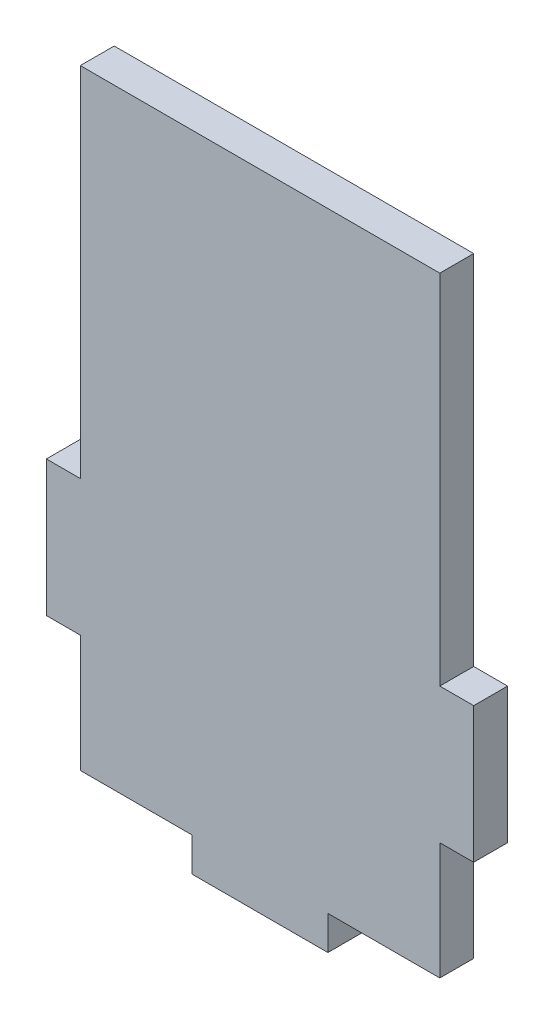
ISO-10303-21;
HEADER;
FILE_DESCRIPTION(('STEP AP214'),'2;1');
FILE_NAME('part.step','',(''),(''),'','','');
FILE_SCHEMA(('AUTOMOTIVE_DESIGN { 1 0 10303 214 1 1 1 1 }'));
ENDSEC;
DATA;
#1=APPLICATION_CONTEXT('core data for automotive mechanical design processes');
#2=APPLICATION_PROTOCOL_DEFINITION('international standard','automotive_design',2000,#1);
#3=PRODUCT_CONTEXT('',#1,'mechanical');
#4=PRODUCT('Part','Part','',(#3));
#5=PRODUCT_RELATED_PRODUCT_CATEGORY('part','',(#4));
#6=PRODUCT_DEFINITION_FORMATION('','',#4);
#7=PRODUCT_DEFINITION_CONTEXT('part definition',#1,'design');
#8=PRODUCT_DEFINITION('design','',#6,#7);
#9=PRODUCT_DEFINITION_SHAPE('','',#8);
#10=(LENGTH_UNIT() NAMED_UNIT(*) SI_UNIT(.MILLI.,.METRE.));
#11=(NAMED_UNIT(*) PLANE_ANGLE_UNIT() SI_UNIT($,.RADIAN.));
#12=(NAMED_UNIT(*) SI_UNIT($,.STERADIAN.) SOLID_ANGLE_UNIT());
#13=UNCERTAINTY_MEASURE_WITH_UNIT(LENGTH_MEASURE(1.E-05),#10,'distance_accuracy_value','');
#14=(GEOMETRIC_REPRESENTATION_CONTEXT(3) GLOBAL_UNCERTAINTY_ASSIGNED_CONTEXT((#13)) GLOBAL_UNIT_ASSIGNED_CONTEXT((#10,
#11,#12)) REPRESENTATION_CONTEXT('',''));
#15=CARTESIAN_POINT('',(0.,0.,0.));
#16=DIRECTION('',(0.,0.,1.));
#17=DIRECTION('',(1.,0.,0.));
#18=AXIS2_PLACEMENT_3D('',#15,#16,#17);
#19=CARTESIAN_POINT('',(26.5,0.,5.));
#20=DIRECTION('',(1.,0.,0.));
#21=DIRECTION('',(0.,0.,-1.));
#22=AXIS2_PLACEMENT_3D('',#19,#20,#21);
#23=PLANE('',#22);
#24=DIRECTION('',(0.,-1.,0.));
#25=VECTOR('',#24,1.);
#26=CARTESIAN_POINT('',(26.5,0.,0.));
#27=LINE('',#26,#25);
#28=CARTESIAN_POINT('',(26.5,-27.7248614841831,0.));
#29=VERTEX_POINT('',#28);
#30=CARTESIAN_POINT('',(26.5,-45.,0.));
#31=VERTEX_POINT('',#30);
#32=EDGE_CURVE('E174',#29,#31,#27,.T.);
#33=ORIENTED_EDGE('',*,*,#32,.F.);
#34=DIRECTION('',(0.,0.,-1.));
#35=VECTOR('',#34,1.);
#36=CARTESIAN_POINT('',(26.5,-27.7248614841831,5.));
#37=LINE('',#36,#35);
#38=CARTESIAN_POINT('',(26.5,-27.7248614841831,5.));
#39=VERTEX_POINT('',#38);
#40=EDGE_CURVE('E11',#39,#29,#37,.T.);
#41=ORIENTED_EDGE('',*,*,#40,.F.);
#42=DIRECTION('',(0.,-1.,0.));
#43=VECTOR('',#42,1.);
#44=CARTESIAN_POINT('',(26.5,0.,5.));
#45=LINE('',#44,#43);
#46=CARTESIAN_POINT('',(26.5,-45.,5.));
#47=VERTEX_POINT('',#46);
#48=EDGE_CURVE('E214',#39,#47,#45,.T.);
#49=ORIENTED_EDGE('',*,*,#48,.T.);
#50=DIRECTION('',(0.,0.,-1.));
#51=VECTOR('',#50,1.);
#52=CARTESIAN_POINT('',(26.5,-45.,5.));
#53=LINE('',#52,#51);
#54=EDGE_CURVE('E107',#47,#31,#53,.T.);
#55=ORIENTED_EDGE('',*,*,#54,.T.);
#56=EDGE_LOOP('',(#33,#41,#49,#55));
#57=FACE_BOUND('',#56,.T.);
#58=ADVANCED_FACE('F33',(#57),#23,.T.);
#59=CARTESIAN_POINT('',(-1.11022302462516E-13,-27.724861484183,5.));
#60=DIRECTION('',(0.,-1.,0.));
#61=DIRECTION('',(1.,0.,0.));
#62=AXIS2_PLACEMENT_3D('',#59,#60,#61);
#63=PLANE('',#62);
#64=DIRECTION('',(-1.,0.,0.));
#65=VECTOR('',#64,1.);
#66=CARTESIAN_POINT('',(-1.11022302462516E-13,-27.724861484183,0.));
#67=LINE('',#66,#65);
#68=CARTESIAN_POINT('',(31.5000000000001,-27.7248614841831,0.));
#69=VERTEX_POINT('',#68);
#70=EDGE_CURVE('E177',#69,#29,#67,.T.);
#71=ORIENTED_EDGE('',*,*,#70,.F.);
#72=DIRECTION('',(0.,0.,-1.));
#73=VECTOR('',#72,1.);
#74=CARTESIAN_POINT('',(31.5000000000001,-27.7248614841831,5.));
#75=LINE('',#74,#73);
#76=CARTESIAN_POINT('',(31.5000000000001,-27.7248614841831,5.));
#77=VERTEX_POINT('',#76);
#78=EDGE_CURVE('E41',#77,#69,#75,.T.);
#79=ORIENTED_EDGE('',*,*,#78,.F.);
#80=DIRECTION('',(-1.,0.,0.));
#81=VECTOR('',#80,1.);
#82=CARTESIAN_POINT('',(-1.11022302462516E-13,-27.724861484183,5.));
#83=LINE('',#82,#81);
#84=EDGE_CURVE('E264',#77,#39,#83,.T.);
#85=ORIENTED_EDGE('',*,*,#84,.T.);
#86=ORIENTED_EDGE('',*,*,#40,.T.);
#87=EDGE_LOOP('',(#71,#79,#85,#86));
#88=FACE_BOUND('',#87,.T.);
#89=ADVANCED_FACE('F250',(#88),#63,.T.);
#90=CARTESIAN_POINT('',(31.5000000000001,0.,5.));
#91=DIRECTION('',(1.,0.,0.));
#92=DIRECTION('',(0.,1.,0.));
#93=AXIS2_PLACEMENT_3D('',#90,#91,#92);
#94=PLANE('',#93);
#95=DIRECTION('',(0.,-1.,0.));
#96=VECTOR('',#95,1.);
#97=CARTESIAN_POINT('',(31.5000000000001,0.,0.));
#98=LINE('',#97,#96);
#99=CARTESIAN_POINT('',(31.5000000000001,-7.72486148418305,0.));
#100=VERTEX_POINT('',#99);
#101=EDGE_CURVE('E180',#100,#69,#98,.T.);
#102=ORIENTED_EDGE('',*,*,#101,.F.);
#103=DIRECTION('',(0.,0.,-1.));
#104=VECTOR('',#103,1.);
#105=CARTESIAN_POINT('',(31.5000000000001,-7.72486148418305,5.));
#106=LINE('',#105,#104);
#107=CARTESIAN_POINT('',(31.5000000000001,-7.72486148418305,5.));
#108=VERTEX_POINT('',#107);
#109=EDGE_CURVE('E239',#108,#100,#106,.T.);
#110=ORIENTED_EDGE('',*,*,#109,.F.);
#111=DIRECTION('',(0.,-1.,0.));
#112=VECTOR('',#111,1.);
#113=CARTESIAN_POINT('',(31.5000000000001,0.,5.));
#114=LINE('',#113,#112);
#115=EDGE_CURVE('E246',#108,#77,#114,.T.);
#116=ORIENTED_EDGE('',*,*,#115,.T.);
#117=ORIENTED_EDGE('',*,*,#78,.T.);
#118=EDGE_LOOP('',(#102,#110,#116,#117));
#119=FACE_BOUND('',#118,.T.);
#120=ADVANCED_FACE('F244',(#119),#94,.T.);
#121=CARTESIAN_POINT('',(0.,-7.724861484183,5.));
#122=DIRECTION('',(0.,-1.,0.));
#123=DIRECTION('',(1.,0.,0.));
#124=AXIS2_PLACEMENT_3D('',#121,#122,#123);
#125=PLANE('',#124);
#126=DIRECTION('',(-1.,0.,0.));
#127=VECTOR('',#126,1.);
#128=CARTESIAN_POINT('',(0.,-7.724861484183,0.));
#129=LINE('',#128,#127);
#130=CARTESIAN_POINT('',(26.5,-7.72486148418305,0.));
#131=VERTEX_POINT('',#130);
#132=EDGE_CURVE('E183',#100,#131,#129,.T.);
#133=ORIENTED_EDGE('',*,*,#132,.T.);
#134=DIRECTION('',(0.,0.,-1.));
#135=VECTOR('',#134,1.);
#136=CARTESIAN_POINT('',(26.5,-7.72486148418305,5.));
#137=LINE('',#136,#135);
#138=CARTESIAN_POINT('',(26.5,-7.72486148418305,5.));
#139=VERTEX_POINT('',#138);
#140=EDGE_CURVE('E237',#139,#131,#137,.T.);
#141=ORIENTED_EDGE('',*,*,#140,.F.);
#142=DIRECTION('',(-1.,0.,0.));
#143=VECTOR('',#142,1.);
#144=CARTESIAN_POINT('',(0.,-7.724861484183,5.));
#145=LINE('',#144,#143);
#146=EDGE_CURVE('E260',#108,#139,#145,.T.);
#147=ORIENTED_EDGE('',*,*,#146,.F.);
#148=ORIENTED_EDGE('',*,*,#109,.T.);
#149=EDGE_LOOP('',(#133,#141,#147,#148));
#150=FACE_BOUND('',#149,.T.);
#151=ADVANCED_FACE('F257',(#150),#125,.F.);
#152=CARTESIAN_POINT('',(26.5,0.,5.));
#153=DIRECTION('',(1.,0.,0.));
#154=DIRECTION('',(0.,1.,0.));
#155=AXIS2_PLACEMENT_3D('',#152,#153,#154);
#156=PLANE('',#155);
#157=DIRECTION('',(0.,-1.,0.));
#158=VECTOR('',#157,1.);
#159=CARTESIAN_POINT('',(26.5,0.,0.));
#160=LINE('',#159,#158);
#161=CARTESIAN_POINT('',(26.5,45.,0.));
#162=VERTEX_POINT('',#161);
#163=EDGE_CURVE('E186',#162,#131,#160,.T.);
#164=ORIENTED_EDGE('',*,*,#163,.F.);
#165=DIRECTION('',(0.,0.,-1.));
#166=VECTOR('',#165,1.);
#167=CARTESIAN_POINT('',(26.5,45.,5.));
#168=LINE('',#167,#166);
#169=CARTESIAN_POINT('',(26.5,45.,5.));
#170=VERTEX_POINT('',#169);
#171=EDGE_CURVE('E235',#170,#162,#168,.T.);
#172=ORIENTED_EDGE('',*,*,#171,.F.);
#173=DIRECTION('',(0.,-1.,0.));
#174=VECTOR('',#173,1.);
#175=CARTESIAN_POINT('',(26.5,0.,5.));
#176=LINE('',#175,#174);
#177=EDGE_CURVE('E262',#170,#139,#176,.T.);
#178=ORIENTED_EDGE('',*,*,#177,.T.);
#179=ORIENTED_EDGE('',*,*,#140,.T.);
#180=EDGE_LOOP('',(#164,#172,#178,#179));
#181=FACE_BOUND('',#180,.T.);
#182=ADVANCED_FACE('F307',(#181),#156,.T.);
#183=CARTESIAN_POINT('',(0.,45.,5.));
#184=DIRECTION('',(0.,1.,0.));
#185=DIRECTION('',(0.,0.,1.));
#186=AXIS2_PLACEMENT_3D('',#183,#184,#185);
#187=PLANE('',#186);
#188=DIRECTION('',(1.,0.,0.));
#189=VECTOR('',#188,1.);
#190=CARTESIAN_POINT('',(0.,45.,0.));
#191=LINE('',#190,#189);
#192=CARTESIAN_POINT('',(-26.5,45.,0.));
#193=VERTEX_POINT('',#192);
#194=EDGE_CURVE('E189',#193,#162,#191,.T.);
#195=ORIENTED_EDGE('',*,*,#194,.F.);
#196=DIRECTION('',(0.,0.,-1.));
#197=VECTOR('',#196,1.);
#198=CARTESIAN_POINT('',(-26.5,45.,5.));
#199=LINE('',#198,#197);
#200=CARTESIAN_POINT('',(-26.5,45.,5.));
#201=VERTEX_POINT('',#200);
#202=EDGE_CURVE('E233',#201,#193,#199,.T.);
#203=ORIENTED_EDGE('',*,*,#202,.F.);
#204=DIRECTION('',(1.,0.,0.));
#205=VECTOR('',#204,1.);
#206=CARTESIAN_POINT('',(0.,45.,5.));
#207=LINE('',#206,#205);
#208=EDGE_CURVE('E270',#201,#170,#207,.T.);
#209=ORIENTED_EDGE('',*,*,#208,.T.);
#210=ORIENTED_EDGE('',*,*,#171,.T.);
#211=EDGE_LOOP('',(#195,#203,#209,#210));
#212=FACE_BOUND('',#211,.T.);
#213=ADVANCED_FACE('F310',(#212),#187,.T.);
#214=CARTESIAN_POINT('',(-26.5,0.,5.));
#215=DIRECTION('',(1.,0.,0.));
#216=DIRECTION('',(0.,1.,0.));
#217=AXIS2_PLACEMENT_3D('',#214,#215,#216);
#218=PLANE('',#217);
#219=DIRECTION('',(0.,-1.,0.));
#220=VECTOR('',#219,1.);
#221=CARTESIAN_POINT('',(-26.5,0.,0.));
#222=LINE('',#221,#220);
#223=CARTESIAN_POINT('',(-26.5,-7.72486148418305,0.));
#224=VERTEX_POINT('',#223);
#225=EDGE_CURVE('E192',#193,#224,#222,.T.);
#226=ORIENTED_EDGE('',*,*,#225,.T.);
#227=DIRECTION('',(0.,0.,-1.));
#228=VECTOR('',#227,1.);
#229=CARTESIAN_POINT('',(-26.5,-7.72486148418305,5.));
#230=LINE('',#229,#228);
#231=CARTESIAN_POINT('',(-26.5,-7.72486148418305,5.));
#232=VERTEX_POINT('',#231);
#233=EDGE_CURVE('E231',#232,#224,#230,.T.);
#234=ORIENTED_EDGE('',*,*,#233,.F.);
#235=DIRECTION('',(0.,-1.,0.));
#236=VECTOR('',#235,1.);
#237=CARTESIAN_POINT('',(-26.5,0.,5.));
#238=LINE('',#237,#236);
#239=EDGE_CURVE('E273',#201,#232,#238,.T.);
#240=ORIENTED_EDGE('',*,*,#239,.F.);
#241=ORIENTED_EDGE('',*,*,#202,.T.);
#242=EDGE_LOOP('',(#226,#234,#240,#241));
#243=FACE_BOUND('',#242,.T.);
#244=ADVANCED_FACE('F314',(#243),#218,.F.);
#245=CARTESIAN_POINT('',(0.,-7.724861484183,5.));
#246=DIRECTION('',(0.,1.,0.));
#247=DIRECTION('',(-1.,0.,0.));
#248=AXIS2_PLACEMENT_3D('',#245,#246,#247);
#249=PLANE('',#248);
#250=DIRECTION('',(1.,0.,0.));
#251=VECTOR('',#250,1.);
#252=CARTESIAN_POINT('',(0.,-7.724861484183,0.));
#253=LINE('',#252,#251);
#254=CARTESIAN_POINT('',(-31.5000000000001,-7.72486148418305,0.));
#255=VERTEX_POINT('',#254);
#256=EDGE_CURVE('E195',#255,#224,#253,.T.);
#257=ORIENTED_EDGE('',*,*,#256,.F.);
#258=DIRECTION('',(0.,0.,-1.));
#259=VECTOR('',#258,1.);
#260=CARTESIAN_POINT('',(-31.5000000000001,-7.72486148418305,5.));
#261=LINE('',#260,#259);
#262=CARTESIAN_POINT('',(-31.5000000000001,-7.72486148418305,5.));
#263=VERTEX_POINT('',#262);
#264=EDGE_CURVE('E229',#263,#255,#261,.T.);
#265=ORIENTED_EDGE('',*,*,#264,.F.);
#266=DIRECTION('',(1.,0.,0.));
#267=VECTOR('',#266,1.);
#268=CARTESIAN_POINT('',(0.,-7.724861484183,5.));
#269=LINE('',#268,#267);
#270=EDGE_CURVE('E275',#263,#232,#269,.T.);
#271=ORIENTED_EDGE('',*,*,#270,.T.);
#272=ORIENTED_EDGE('',*,*,#233,.T.);
#273=EDGE_LOOP('',(#257,#265,#271,#272));
#274=FACE_BOUND('',#273,.T.);
#275=ADVANCED_FACE('F318',(#274),#249,.T.);
#276=CARTESIAN_POINT('',(-31.5000000000001,0.,5.));
#277=DIRECTION('',(1.,0.,0.));
#278=DIRECTION('',(0.,1.,0.));
#279=AXIS2_PLACEMENT_3D('',#276,#277,#278);
#280=PLANE('',#279);
#281=DIRECTION('',(0.,-1.,0.));
#282=VECTOR('',#281,1.);
#283=CARTESIAN_POINT('',(-31.5000000000001,0.,0.));
#284=LINE('',#283,#282);
#285=CARTESIAN_POINT('',(-31.5,-27.7248614841831,0.));
#286=VERTEX_POINT('',#285);
#287=EDGE_CURVE('E198',#255,#286,#284,.T.);
#288=ORIENTED_EDGE('',*,*,#287,.T.);
#289=DIRECTION('',(0.,0.,-1.));
#290=VECTOR('',#289,1.);
#291=CARTESIAN_POINT('',(-31.5,-27.7248614841831,5.));
#292=LINE('',#291,#290);
#293=CARTESIAN_POINT('',(-31.5,-27.7248614841831,5.));
#294=VERTEX_POINT('',#293);
#295=EDGE_CURVE('E226',#294,#286,#292,.T.);
#296=ORIENTED_EDGE('',*,*,#295,.F.);
#297=DIRECTION('',(0.,-1.,0.));
#298=VECTOR('',#297,1.);
#299=CARTESIAN_POINT('',(-31.5000000000001,0.,5.));
#300=LINE('',#299,#298);
#301=EDGE_CURVE('E278',#263,#294,#300,.T.);
#302=ORIENTED_EDGE('',*,*,#301,.F.);
#303=ORIENTED_EDGE('',*,*,#264,.T.);
#304=EDGE_LOOP('',(#288,#296,#302,#303));
#305=FACE_BOUND('',#304,.T.);
#306=ADVANCED_FACE('F322',(#305),#280,.F.);
#307=CARTESIAN_POINT('',(1.11022302462516E-13,-27.724861484183,5.));
#308=DIRECTION('',(0.,1.,0.));
#309=DIRECTION('',(-1.,0.,0.));
#310=AXIS2_PLACEMENT_3D('',#307,#308,#309);
#311=PLANE('',#310);
#312=DIRECTION('',(1.,0.,0.));
#313=VECTOR('',#312,1.);
#314=CARTESIAN_POINT('',(1.11022302462516E-13,-27.724861484183,0.));
#315=LINE('',#314,#313);
#316=CARTESIAN_POINT('',(-26.5,-27.7248614841831,0.));
#317=VERTEX_POINT('',#316);
#318=EDGE_CURVE('E200',#286,#317,#315,.T.);
#319=ORIENTED_EDGE('',*,*,#318,.T.);
#320=DIRECTION('',(0.,0.,-1.));
#321=VECTOR('',#320,1.);
#322=CARTESIAN_POINT('',(-26.5,-27.7248614841831,5.));
#323=LINE('',#322,#321);
#324=CARTESIAN_POINT('',(-26.5,-27.7248614841831,5.));
#325=VERTEX_POINT('',#324);
#326=EDGE_CURVE('E223',#325,#317,#323,.T.);
#327=ORIENTED_EDGE('',*,*,#326,.F.);
#328=DIRECTION('',(1.,0.,0.));
#329=VECTOR('',#328,1.);
#330=CARTESIAN_POINT('',(1.11022302462516E-13,-27.724861484183,5.));
#331=LINE('',#330,#329);
#332=EDGE_CURVE('E280',#294,#325,#331,.T.);
#333=ORIENTED_EDGE('',*,*,#332,.F.);
#334=ORIENTED_EDGE('',*,*,#295,.T.);
#335=EDGE_LOOP('',(#319,#327,#333,#334));
#336=FACE_BOUND('',#335,.T.);
#337=ADVANCED_FACE('F326',(#336),#311,.F.);
#338=CARTESIAN_POINT('',(-26.5,0.,5.));
#339=DIRECTION('',(1.,0.,0.));
#340=DIRECTION('',(0.,0.,-1.));
#341=AXIS2_PLACEMENT_3D('',#338,#339,#340);
#342=PLANE('',#341);
#343=DIRECTION('',(0.,-1.,0.));
#344=VECTOR('',#343,1.);
#345=CARTESIAN_POINT('',(-26.5,0.,0.));
#346=LINE('',#345,#344);
#347=CARTESIAN_POINT('',(-26.5,-45.,0.));
#348=VERTEX_POINT('',#347);
#349=EDGE_CURVE('E202',#317,#348,#346,.T.);
#350=ORIENTED_EDGE('',*,*,#349,.T.);
#351=DIRECTION('',(0.,0.,-1.));
#352=VECTOR('',#351,1.);
#353=CARTESIAN_POINT('',(-26.5,-45.,5.));
#354=LINE('',#353,#352);
#355=CARTESIAN_POINT('',(-26.5,-45.,5.));
#356=VERTEX_POINT('',#355);
#357=EDGE_CURVE('E220',#356,#348,#354,.T.);
#358=ORIENTED_EDGE('',*,*,#357,.F.);
#359=DIRECTION('',(0.,-1.,0.));
#360=VECTOR('',#359,1.);
#361=CARTESIAN_POINT('',(-26.5,0.,5.));
#362=LINE('',#361,#360);
#363=EDGE_CURVE('E282',#325,#356,#362,.T.);
#364=ORIENTED_EDGE('',*,*,#363,.F.);
#365=ORIENTED_EDGE('',*,*,#326,.T.);
#366=EDGE_LOOP('',(#350,#358,#364,#365));
#367=FACE_BOUND('',#366,.T.);
#368=ADVANCED_FACE('F330',(#367),#342,.F.);
#369=CARTESIAN_POINT('',(1.11022302462516E-13,-44.9999999999999,5.));
#370=DIRECTION('',(0.,1.,0.));
#371=DIRECTION('',(-1.,0.,0.));
#372=AXIS2_PLACEMENT_3D('',#369,#370,#371);
#373=PLANE('',#372);
#374=DIRECTION('',(1.,0.,0.));
#375=VECTOR('',#374,1.);
#376=CARTESIAN_POINT('',(1.11022302462516E-13,-44.9999999999999,0.));
#377=LINE('',#376,#375);
#378=CARTESIAN_POINT('',(-10.0463802588001,-45.,0.));
#379=VERTEX_POINT('',#378);
#380=EDGE_CURVE('E204',#348,#379,#377,.T.);
#381=ORIENTED_EDGE('',*,*,#380,.T.);
#382=DIRECTION('',(0.,0.,-1.));
#383=VECTOR('',#382,1.);
#384=CARTESIAN_POINT('',(-10.0463802588001,-45.,5.));
#385=LINE('',#384,#383);
#386=CARTESIAN_POINT('',(-10.0463802588001,-45.,5.));
#387=VERTEX_POINT('',#386);
#388=EDGE_CURVE('E218',#387,#379,#385,.T.);
#389=ORIENTED_EDGE('',*,*,#388,.F.);
#390=DIRECTION('',(1.,0.,0.));
#391=VECTOR('',#390,1.);
#392=CARTESIAN_POINT('',(1.11022302462516E-13,-44.9999999999999,5.));
#393=LINE('',#392,#391);
#394=EDGE_CURVE('E169',#356,#387,#393,.T.);
#395=ORIENTED_EDGE('',*,*,#394,.F.);
#396=ORIENTED_EDGE('',*,*,#357,.T.);
#397=EDGE_LOOP('',(#381,#389,#395,#396));
#398=FACE_BOUND('',#397,.T.);
#399=ADVANCED_FACE('F288',(#398),#373,.F.);
#400=CARTESIAN_POINT('',(-10.462902306147,-0.0970544233519499,5.));
#401=DIRECTION('',(-0.999956980208086,-0.00927565270621449,0.));
#402=DIRECTION('',(0.00927565270621449,-0.999956980208086,0.));
#403=AXIS2_PLACEMENT_3D('',#400,#401,#402);
#404=PLANE('',#403);
#405=DIRECTION('',(-0.00927565270621448,0.999956980208086,0.));
#406=VECTOR('',#405,1.);
#407=CARTESIAN_POINT('',(-10.462902306147,-0.0970544233519499,0.));
#408=LINE('',#407,#406);
#409=CARTESIAN_POINT('',(-10.,-50.,0.));
#410=VERTEX_POINT('',#409);
#411=EDGE_CURVE('E207',#410,#379,#408,.T.);
#412=ORIENTED_EDGE('',*,*,#411,.F.);
#413=DIRECTION('',(0.,0.,-1.));
#414=VECTOR('',#413,1.);
#415=CARTESIAN_POINT('',(-10.,-50.,5.));
#416=LINE('',#415,#414);
#417=CARTESIAN_POINT('',(-10.,-50.,5.));
#418=VERTEX_POINT('',#417);
#419=EDGE_CURVE('E158',#418,#410,#416,.T.);
#420=ORIENTED_EDGE('',*,*,#419,.F.);
#421=DIRECTION('',(-0.00927565270621448,0.999956980208086,0.));
#422=VECTOR('',#421,1.);
#423=CARTESIAN_POINT('',(-10.462902306147,-0.0970544233519499,5.));
#424=LINE('',#423,#422);
#425=EDGE_CURVE('E167',#418,#387,#424,.T.);
#426=ORIENTED_EDGE('',*,*,#425,.T.);
#427=ORIENTED_EDGE('',*,*,#388,.T.);
#428=EDGE_LOOP('',(#412,#420,#426,#427));
#429=FACE_BOUND('',#428,.T.);
#430=ADVANCED_FACE('F292',(#429),#404,.T.);
#431=CARTESIAN_POINT('',(0.,-50.,5.));
#432=DIRECTION('',(0.,-1.,0.));
#433=DIRECTION('',(1.,0.,0.));
#434=AXIS2_PLACEMENT_3D('',#431,#432,#433);
#435=PLANE('',#434);
#436=DIRECTION('',(-1.,0.,0.));
#437=VECTOR('',#436,1.);
#438=CARTESIAN_POINT('',(0.,-50.,0.));
#439=LINE('',#438,#437);
#440=CARTESIAN_POINT('',(10.,-50.,0.));
#441=VERTEX_POINT('',#440);
#442=EDGE_CURVE('E157',#441,#410,#439,.T.);
#443=ORIENTED_EDGE('',*,*,#442,.F.);
#444=DIRECTION('',(0.,0.,-1.));
#445=VECTOR('',#444,1.);
#446=CARTESIAN_POINT('',(10.,-50.,5.));
#447=LINE('',#446,#445);
#448=CARTESIAN_POINT('',(10.,-50.,5.));
#449=VERTEX_POINT('',#448);
#450=EDGE_CURVE('E151',#449,#441,#447,.T.);
#451=ORIENTED_EDGE('',*,*,#450,.F.);
#452=DIRECTION('',(-1.,0.,0.));
#453=VECTOR('',#452,1.);
#454=CARTESIAN_POINT('',(0.,-50.,5.));
#455=LINE('',#454,#453);
#456=EDGE_CURVE('E155',#449,#418,#455,.T.);
#457=ORIENTED_EDGE('',*,*,#456,.T.);
#458=ORIENTED_EDGE('',*,*,#419,.T.);
#459=EDGE_LOOP('',(#443,#451,#457,#458));
#460=FACE_BOUND('',#459,.T.);
#461=ADVANCED_FACE('F153',(#460),#435,.T.);
#462=CARTESIAN_POINT('',(10.,0.,5.));
#463=DIRECTION('',(-1.,0.,0.));
#464=DIRECTION('',(0.,-1.,0.));
#465=AXIS2_PLACEMENT_3D('',#462,#463,#464);
#466=PLANE('',#465);
#467=DIRECTION('',(0.,1.,0.));
#468=VECTOR('',#467,1.);
#469=CARTESIAN_POINT('',(10.,0.,0.));
#470=LINE('',#469,#468);
#471=CARTESIAN_POINT('',(10.,-45.,0.));
#472=VERTEX_POINT('',#471);
#473=EDGE_CURVE('E100',#441,#472,#470,.T.);
#474=ORIENTED_EDGE('',*,*,#473,.T.);
#475=DIRECTION('',(0.,0.,-1.));
#476=VECTOR('',#475,1.);
#477=CARTESIAN_POINT('',(10.,-45.,5.));
#478=LINE('',#477,#476);
#479=CARTESIAN_POINT('',(10.,-45.,5.));
#480=VERTEX_POINT('',#479);
#481=EDGE_CURVE('E159',#480,#472,#478,.T.);
#482=ORIENTED_EDGE('',*,*,#481,.F.);
#483=DIRECTION('',(0.,1.,0.));
#484=VECTOR('',#483,1.);
#485=CARTESIAN_POINT('',(10.,0.,5.));
#486=LINE('',#485,#484);
#487=EDGE_CURVE('E161',#449,#480,#486,.T.);
#488=ORIENTED_EDGE('',*,*,#487,.F.);
#489=ORIENTED_EDGE('',*,*,#450,.T.);
#490=EDGE_LOOP('',(#474,#482,#488,#489));
#491=FACE_BOUND('',#490,.T.);
#492=ADVANCED_FACE('F162',(#491),#466,.F.);
#493=CARTESIAN_POINT('',(0.,-45.,5.));
#494=DIRECTION('',(0.,1.,0.));
#495=DIRECTION('',(0.,0.,1.));
#496=AXIS2_PLACEMENT_3D('',#493,#494,#495);
#497=PLANE('',#496);
#498=DIRECTION('',(1.,0.,0.));
#499=VECTOR('',#498,1.);
#500=CARTESIAN_POINT('',(0.,-45.,0.));
#501=LINE('',#500,#499);
#502=EDGE_CURVE('E212',#472,#31,#501,.T.);
#503=ORIENTED_EDGE('',*,*,#502,.T.);
#504=ORIENTED_EDGE('',*,*,#54,.F.);
#505=DIRECTION('',(1.,0.,0.));
#506=VECTOR('',#505,1.);
#507=CARTESIAN_POINT('',(0.,-45.,5.));
#508=LINE('',#507,#506);
#509=EDGE_CURVE('E49',#480,#47,#508,.T.);
#510=ORIENTED_EDGE('',*,*,#509,.F.);
#511=ORIENTED_EDGE('',*,*,#481,.T.);
#512=EDGE_LOOP('',(#503,#504,#510,#511));
#513=FACE_BOUND('',#512,.T.);
#514=ADVANCED_FACE('F295',(#513),#497,.F.);
#515=CARTESIAN_POINT('',(0.,0.,5.));
#516=DIRECTION('',(0.,0.,1.));
#517=DIRECTION('',(1.,0.,0.));
#518=AXIS2_PLACEMENT_3D('',#515,#516,#517);
#519=PLANE('',#518);
#520=ORIENTED_EDGE('',*,*,#48,.F.);
#521=ORIENTED_EDGE('',*,*,#84,.F.);
#522=ORIENTED_EDGE('',*,*,#115,.F.);
#523=ORIENTED_EDGE('',*,*,#146,.T.);
#524=ORIENTED_EDGE('',*,*,#177,.F.);
#525=ORIENTED_EDGE('',*,*,#208,.F.);
#526=ORIENTED_EDGE('',*,*,#239,.T.);
#527=ORIENTED_EDGE('',*,*,#270,.F.);
#528=ORIENTED_EDGE('',*,*,#301,.T.);
#529=ORIENTED_EDGE('',*,*,#332,.T.);
#530=ORIENTED_EDGE('',*,*,#363,.T.);
#531=ORIENTED_EDGE('',*,*,#394,.T.);
#532=ORIENTED_EDGE('',*,*,#425,.F.);
#533=ORIENTED_EDGE('',*,*,#456,.F.);
#534=ORIENTED_EDGE('',*,*,#487,.T.);
#535=ORIENTED_EDGE('',*,*,#509,.T.);
#536=EDGE_LOOP('',(#520,#521,#522,#523,#524,#525,#526,#527,#528,#529,#530,#531,#532,#533,#534,#535));
#537=FACE_BOUND('',#536,.T.);
#538=ADVANCED_FACE('F165',(#537),#519,.T.);
#539=CARTESIAN_POINT('',(0.,0.,0.));
#540=DIRECTION('',(0.,0.,1.));
#541=DIRECTION('',(1.,0.,0.));
#542=AXIS2_PLACEMENT_3D('',#539,#540,#541);
#543=PLANE('',#542);
#544=ORIENTED_EDGE('',*,*,#32,.T.);
#545=ORIENTED_EDGE('',*,*,#502,.F.);
#546=ORIENTED_EDGE('',*,*,#473,.F.);
#547=ORIENTED_EDGE('',*,*,#442,.T.);
#548=ORIENTED_EDGE('',*,*,#411,.T.);
#549=ORIENTED_EDGE('',*,*,#380,.F.);
#550=ORIENTED_EDGE('',*,*,#349,.F.);
#551=ORIENTED_EDGE('',*,*,#318,.F.);
#552=ORIENTED_EDGE('',*,*,#287,.F.);
#553=ORIENTED_EDGE('',*,*,#256,.T.);
#554=ORIENTED_EDGE('',*,*,#225,.F.);
#555=ORIENTED_EDGE('',*,*,#194,.T.);
#556=ORIENTED_EDGE('',*,*,#163,.T.);
#557=ORIENTED_EDGE('',*,*,#132,.F.);
#558=ORIENTED_EDGE('',*,*,#101,.T.);
#559=ORIENTED_EDGE('',*,*,#70,.T.);
#560=EDGE_LOOP('',(#544,#545,#546,#547,#548,#549,#550,#551,#552,#553,#554,#555,#556,#557,#558,#559));
#561=FACE_BOUND('',#560,.T.);
#562=ADVANCED_FACE('F253',(#561),#543,.F.);
#563=CLOSED_SHELL('',(#58,#89,#120,#151,#182,#213,#244,#275,#306,#337,#368,#399,#430,#461,#492,
#514,#538,#562));
#564=MANIFOLD_SOLID_BREP('B2',#563);
#565=ADVANCED_BREP_SHAPE_REPRESENTATION('',(#18,#564),#14);
#566=SHAPE_DEFINITION_REPRESENTATION(#9,#565);
ENDSEC;
END-ISO-10303-21;
